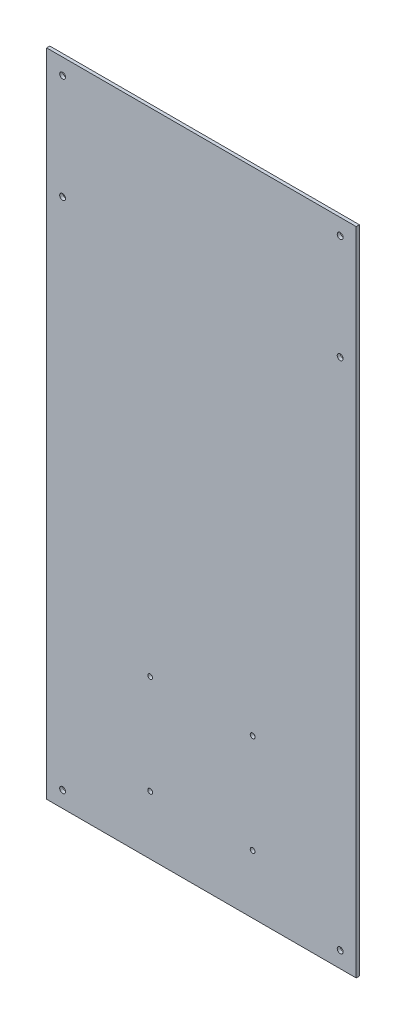
ISO-10303-21;
HEADER;
FILE_DESCRIPTION(('STEP AP214'),'2;1');
FILE_NAME('part.step','',(''),(''),'','','');
FILE_SCHEMA(('AUTOMOTIVE_DESIGN { 1 0 10303 214 1 1 1 1 }'));
ENDSEC;
DATA;
#1=APPLICATION_CONTEXT('core data for automotive mechanical design processes');
#2=APPLICATION_PROTOCOL_DEFINITION('international standard','automotive_design',2000,#1);
#3=PRODUCT_CONTEXT('',#1,'mechanical');
#4=PRODUCT('Part','Part','',(#3));
#5=PRODUCT_RELATED_PRODUCT_CATEGORY('part','',(#4));
#6=PRODUCT_DEFINITION_FORMATION('','',#4);
#7=PRODUCT_DEFINITION_CONTEXT('part definition',#1,'design');
#8=PRODUCT_DEFINITION('design','',#6,#7);
#9=PRODUCT_DEFINITION_SHAPE('','',#8);
#10=(LENGTH_UNIT() NAMED_UNIT(*) SI_UNIT(.MILLI.,.METRE.));
#11=(NAMED_UNIT(*) PLANE_ANGLE_UNIT() SI_UNIT($,.RADIAN.));
#12=(NAMED_UNIT(*) SI_UNIT($,.STERADIAN.) SOLID_ANGLE_UNIT());
#13=UNCERTAINTY_MEASURE_WITH_UNIT(LENGTH_MEASURE(1.E-05),#10,'distance_accuracy_value','');
#14=(GEOMETRIC_REPRESENTATION_CONTEXT(3) GLOBAL_UNCERTAINTY_ASSIGNED_CONTEXT((#13)) GLOBAL_UNIT_ASSIGNED_CONTEXT((#10,
#11,#12)) REPRESENTATION_CONTEXT('',''));
#15=CARTESIAN_POINT('',(0.,0.,0.));
#16=DIRECTION('',(0.,0.,1.));
#17=DIRECTION('',(1.,0.,0.));
#18=AXIS2_PLACEMENT_3D('',#15,#16,#17);
#19=CARTESIAN_POINT('',(145.,304.8,3.));
#20=DIRECTION('',(-1.,0.,0.));
#21=DIRECTION('',(0.,-1.,0.));
#22=AXIS2_PLACEMENT_3D('',#19,#20,#21);
#23=PLANE('',#22);
#24=DIRECTION('',(0.,1.,0.));
#25=VECTOR('',#24,1.);
#26=CARTESIAN_POINT('',(145.,304.8,0.));
#27=LINE('',#26,#25);
#28=CARTESIAN_POINT('',(145.,-304.8,0.));
#29=VERTEX_POINT('',#28);
#30=CARTESIAN_POINT('',(145.,304.8,0.));
#31=VERTEX_POINT('',#30);
#32=EDGE_CURVE('E98',#29,#31,#27,.T.);
#33=ORIENTED_EDGE('',*,*,#32,.T.);
#34=DIRECTION('',(0.,0.,-1.));
#35=VECTOR('',#34,1.);
#36=CARTESIAN_POINT('',(145.,304.8,3.));
#37=LINE('',#36,#35);
#38=CARTESIAN_POINT('',(145.,304.8,3.));
#39=VERTEX_POINT('',#38);
#40=EDGE_CURVE('E11',#39,#31,#37,.T.);
#41=ORIENTED_EDGE('',*,*,#40,.F.);
#42=DIRECTION('',(0.,1.,0.));
#43=VECTOR('',#42,1.);
#44=CARTESIAN_POINT('',(145.,304.8,3.));
#45=LINE('',#44,#43);
#46=CARTESIAN_POINT('',(145.,-304.8,3.));
#47=VERTEX_POINT('',#46);
#48=EDGE_CURVE('E86',#47,#39,#45,.T.);
#49=ORIENTED_EDGE('',*,*,#48,.F.);
#50=DIRECTION('',(0.,0.,-1.));
#51=VECTOR('',#50,1.);
#52=CARTESIAN_POINT('',(145.,-304.8,3.));
#53=LINE('',#52,#51);
#54=EDGE_CURVE('E94',#47,#29,#53,.T.);
#55=ORIENTED_EDGE('',*,*,#54,.T.);
#56=EDGE_LOOP('',(#33,#41,#49,#55));
#57=FACE_BOUND('',#56,.T.);
#58=ADVANCED_FACE('F35',(#57),#23,.F.);
#59=CARTESIAN_POINT('',(-145.,304.8,3.));
#60=DIRECTION('',(0.,-1.,0.));
#61=DIRECTION('',(0.,0.,-1.));
#62=AXIS2_PLACEMENT_3D('',#59,#60,#61);
#63=PLANE('',#62);
#64=DIRECTION('',(-1.,0.,0.));
#65=VECTOR('',#64,1.);
#66=CARTESIAN_POINT('',(-145.,304.8,0.));
#67=LINE('',#66,#65);
#68=CARTESIAN_POINT('',(-145.,304.8,0.));
#69=VERTEX_POINT('',#68);
#70=EDGE_CURVE('E90',#31,#69,#67,.T.);
#71=ORIENTED_EDGE('',*,*,#70,.T.);
#72=DIRECTION('',(0.,0.,-1.));
#73=VECTOR('',#72,1.);
#74=CARTESIAN_POINT('',(-145.,304.8,3.));
#75=LINE('',#74,#73);
#76=CARTESIAN_POINT('',(-145.,304.8,3.));
#77=VERTEX_POINT('',#76);
#78=EDGE_CURVE('E43',#77,#69,#75,.T.);
#79=ORIENTED_EDGE('',*,*,#78,.F.);
#80=DIRECTION('',(-1.,0.,0.));
#81=VECTOR('',#80,1.);
#82=CARTESIAN_POINT('',(-145.,304.8,3.));
#83=LINE('',#82,#81);
#84=EDGE_CURVE('E81',#39,#77,#83,.T.);
#85=ORIENTED_EDGE('',*,*,#84,.F.);
#86=ORIENTED_EDGE('',*,*,#40,.T.);
#87=EDGE_LOOP('',(#71,#79,#85,#86));
#88=FACE_BOUND('',#87,.T.);
#89=ADVANCED_FACE('F89',(#88),#63,.F.);
#90=CARTESIAN_POINT('',(-145.,304.8,3.));
#91=DIRECTION('',(1.,0.,0.));
#92=DIRECTION('',(0.,1.,0.));
#93=AXIS2_PLACEMENT_3D('',#90,#91,#92);
#94=PLANE('',#93);
#95=DIRECTION('',(0.,-1.,0.));
#96=VECTOR('',#95,1.);
#97=CARTESIAN_POINT('',(-145.,304.8,0.));
#98=LINE('',#97,#96);
#99=CARTESIAN_POINT('',(-145.,-304.8,0.));
#100=VERTEX_POINT('',#99);
#101=EDGE_CURVE('E68',#69,#100,#98,.T.);
#102=ORIENTED_EDGE('',*,*,#101,.T.);
#103=DIRECTION('',(0.,0.,-1.));
#104=VECTOR('',#103,1.);
#105=CARTESIAN_POINT('',(-145.,-304.8,3.));
#106=LINE('',#105,#104);
#107=CARTESIAN_POINT('',(-145.,-304.8,3.));
#108=VERTEX_POINT('',#107);
#109=EDGE_CURVE('E91',#108,#100,#106,.T.);
#110=ORIENTED_EDGE('',*,*,#109,.F.);
#111=DIRECTION('',(0.,-1.,0.));
#112=VECTOR('',#111,1.);
#113=CARTESIAN_POINT('',(-145.,304.8,3.));
#114=LINE('',#113,#112);
#115=EDGE_CURVE('E84',#77,#108,#114,.T.);
#116=ORIENTED_EDGE('',*,*,#115,.F.);
#117=ORIENTED_EDGE('',*,*,#78,.T.);
#118=EDGE_LOOP('',(#102,#110,#116,#117));
#119=FACE_BOUND('',#118,.T.);
#120=ADVANCED_FACE('F92',(#119),#94,.F.);
#121=CARTESIAN_POINT('',(-145.,-304.8,3.));
#122=DIRECTION('',(0.,1.,0.));
#123=DIRECTION('',(0.,0.,1.));
#124=AXIS2_PLACEMENT_3D('',#121,#122,#123);
#125=PLANE('',#124);
#126=DIRECTION('',(1.,0.,0.));
#127=VECTOR('',#126,1.);
#128=CARTESIAN_POINT('',(-145.,-304.8,0.));
#129=LINE('',#128,#127);
#130=EDGE_CURVE('E74',#100,#29,#129,.T.);
#131=ORIENTED_EDGE('',*,*,#130,.T.);
#132=ORIENTED_EDGE('',*,*,#54,.F.);
#133=DIRECTION('',(1.,0.,0.));
#134=VECTOR('',#133,1.);
#135=CARTESIAN_POINT('',(-145.,-304.8,3.));
#136=LINE('',#135,#134);
#137=EDGE_CURVE('E51',#108,#47,#136,.T.);
#138=ORIENTED_EDGE('',*,*,#137,.F.);
#139=ORIENTED_EDGE('',*,*,#109,.T.);
#140=EDGE_LOOP('',(#131,#132,#138,#139));
#141=FACE_BOUND('',#140,.T.);
#142=ADVANCED_FACE('F106',(#141),#125,.F.);
#143=CARTESIAN_POINT('',(0.,0.,3.));
#144=DIRECTION('',(0.,0.,1.));
#145=DIRECTION('',(1.,0.,0.));
#146=AXIS2_PLACEMENT_3D('',#143,#144,#145);
#147=PLANE('',#146);
#148=CARTESIAN_POINT('',(-48.,-156.8,3.));
#149=DIRECTION('',(0.,0.,1.));
#150=DIRECTION('',(1.,0.,0.));
#151=AXIS2_PLACEMENT_3D('',#148,#149,#150);
#152=CIRCLE('',#151,2.25);
#153=CARTESIAN_POINT('',(-45.75,-156.8,3.));
#154=VERTEX_POINT('',#153);
#155=EDGE_CURVE('E168',#154,#154,#152,.T.);
#156=ORIENTED_EDGE('',*,*,#155,.F.);
#157=EDGE_LOOP('',(#156));
#158=FACE_BOUND('',#157,.T.);
#159=CARTESIAN_POINT('',(-48.,-249.8,3.));
#160=DIRECTION('',(0.,0.,1.));
#161=DIRECTION('',(1.,0.,0.));
#162=AXIS2_PLACEMENT_3D('',#159,#160,#161);
#163=CIRCLE('',#162,2.25);
#164=CARTESIAN_POINT('',(-45.75,-249.8,3.));
#165=VERTEX_POINT('',#164);
#166=EDGE_CURVE('E162',#165,#165,#163,.T.);
#167=ORIENTED_EDGE('',*,*,#166,.F.);
#168=EDGE_LOOP('',(#167));
#169=FACE_BOUND('',#168,.T.);
#170=CARTESIAN_POINT('',(48.,-249.8,3.));
#171=DIRECTION('',(0.,0.,1.));
#172=DIRECTION('',(1.,0.,0.));
#173=AXIS2_PLACEMENT_3D('',#170,#171,#172);
#174=CIRCLE('',#173,2.25);
#175=CARTESIAN_POINT('',(50.25,-249.8,3.));
#176=VERTEX_POINT('',#175);
#177=EDGE_CURVE('E156',#176,#176,#174,.T.);
#178=ORIENTED_EDGE('',*,*,#177,.F.);
#179=EDGE_LOOP('',(#178));
#180=FACE_BOUND('',#179,.T.);
#181=CARTESIAN_POINT('',(48.,-156.8,3.));
#182=DIRECTION('',(0.,0.,1.));
#183=DIRECTION('',(1.,0.,0.));
#184=AXIS2_PLACEMENT_3D('',#181,#182,#183);
#185=CIRCLE('',#184,2.25);
#186=CARTESIAN_POINT('',(50.25,-156.8,3.));
#187=VERTEX_POINT('',#186);
#188=EDGE_CURVE('E150',#187,#187,#185,.T.);
#189=ORIENTED_EDGE('',*,*,#188,.F.);
#190=EDGE_LOOP('',(#189));
#191=FACE_BOUND('',#190,.T.);
#192=CARTESIAN_POINT('',(129.995,289.795,3.));
#193=DIRECTION('',(0.,0.,1.));
#194=DIRECTION('',(1.,0.,0.));
#195=AXIS2_PLACEMENT_3D('',#192,#193,#194);
#196=CIRCLE('',#195,2.75);
#197=CARTESIAN_POINT('',(132.745,289.795,3.));
#198=VERTEX_POINT('',#197);
#199=EDGE_CURVE('E144',#198,#198,#196,.T.);
#200=ORIENTED_EDGE('',*,*,#199,.F.);
#201=EDGE_LOOP('',(#200));
#202=FACE_BOUND('',#201,.T.);
#203=CARTESIAN_POINT('',(-129.995,289.795,3.));
#204=DIRECTION('',(0.,0.,1.));
#205=DIRECTION('',(1.,0.,0.));
#206=AXIS2_PLACEMENT_3D('',#203,#204,#205);
#207=CIRCLE('',#206,2.75);
#208=CARTESIAN_POINT('',(-127.245,289.795,3.));
#209=VERTEX_POINT('',#208);
#210=EDGE_CURVE('E138',#209,#209,#207,.T.);
#211=ORIENTED_EDGE('',*,*,#210,.F.);
#212=EDGE_LOOP('',(#211));
#213=FACE_BOUND('',#212,.T.);
#214=CARTESIAN_POINT('',(-129.995,-289.795,3.));
#215=DIRECTION('',(0.,0.,1.));
#216=DIRECTION('',(1.,0.,0.));
#217=AXIS2_PLACEMENT_3D('',#214,#215,#216);
#218=CIRCLE('',#217,2.75);
#219=CARTESIAN_POINT('',(-127.245,-289.795,3.));
#220=VERTEX_POINT('',#219);
#221=EDGE_CURVE('E132',#220,#220,#218,.T.);
#222=ORIENTED_EDGE('',*,*,#221,.F.);
#223=EDGE_LOOP('',(#222));
#224=FACE_BOUND('',#223,.T.);
#225=CARTESIAN_POINT('',(129.995,-289.795,3.));
#226=DIRECTION('',(0.,0.,1.));
#227=DIRECTION('',(1.,0.,0.));
#228=AXIS2_PLACEMENT_3D('',#225,#226,#227);
#229=CIRCLE('',#228,2.75);
#230=CARTESIAN_POINT('',(132.745,-289.795,3.));
#231=VERTEX_POINT('',#230);
#232=EDGE_CURVE('E126',#231,#231,#229,.T.);
#233=ORIENTED_EDGE('',*,*,#232,.F.);
#234=EDGE_LOOP('',(#233));
#235=FACE_BOUND('',#234,.T.);
#236=CARTESIAN_POINT('',(129.995,191.395,3.));
#237=DIRECTION('',(0.,0.,1.));
#238=DIRECTION('',(1.,0.,0.));
#239=AXIS2_PLACEMENT_3D('',#236,#237,#238);
#240=CIRCLE('',#239,2.75);
#241=CARTESIAN_POINT('',(132.745,191.395,3.));
#242=VERTEX_POINT('',#241);
#243=EDGE_CURVE('E120',#242,#242,#240,.T.);
#244=ORIENTED_EDGE('',*,*,#243,.F.);
#245=EDGE_LOOP('',(#244));
#246=FACE_BOUND('',#245,.T.);
#247=CARTESIAN_POINT('',(-129.995,191.395,3.));
#248=DIRECTION('',(0.,0.,1.));
#249=DIRECTION('',(1.,0.,0.));
#250=AXIS2_PLACEMENT_3D('',#247,#248,#249);
#251=CIRCLE('',#250,2.75);
#252=CARTESIAN_POINT('',(-127.245,191.395,3.));
#253=VERTEX_POINT('',#252);
#254=EDGE_CURVE('E114',#253,#253,#251,.T.);
#255=ORIENTED_EDGE('',*,*,#254,.F.);
#256=EDGE_LOOP('',(#255));
#257=FACE_BOUND('',#256,.T.);
#258=ORIENTED_EDGE('',*,*,#48,.T.);
#259=ORIENTED_EDGE('',*,*,#84,.T.);
#260=ORIENTED_EDGE('',*,*,#115,.T.);
#261=ORIENTED_EDGE('',*,*,#137,.T.);
#262=EDGE_LOOP('',(#258,#259,#260,#261));
#263=FACE_BOUND('',#262,.T.);
#264=ADVANCED_FACE('F82',(#158,#169,#180,#191,#202,#213,#224,#235,#246,#257,#263),#147,.T.);
#265=CARTESIAN_POINT('',(0.,0.,0.));
#266=DIRECTION('',(0.,0.,1.));
#267=DIRECTION('',(1.,0.,0.));
#268=AXIS2_PLACEMENT_3D('',#265,#266,#267);
#269=PLANE('',#268);
#270=CARTESIAN_POINT('',(-48.,-156.8,0.));
#271=DIRECTION('',(0.,0.,1.));
#272=DIRECTION('',(1.,0.,0.));
#273=AXIS2_PLACEMENT_3D('',#270,#271,#272);
#274=CIRCLE('',#273,2.25);
#275=CARTESIAN_POINT('',(-45.75,-156.8,0.));
#276=VERTEX_POINT('',#275);
#277=EDGE_CURVE('E165',#276,#276,#274,.T.);
#278=ORIENTED_EDGE('',*,*,#277,.T.);
#279=EDGE_LOOP('',(#278));
#280=FACE_BOUND('',#279,.T.);
#281=CARTESIAN_POINT('',(-48.,-249.8,0.));
#282=DIRECTION('',(0.,0.,1.));
#283=DIRECTION('',(1.,0.,0.));
#284=AXIS2_PLACEMENT_3D('',#281,#282,#283);
#285=CIRCLE('',#284,2.25);
#286=CARTESIAN_POINT('',(-45.75,-249.8,0.));
#287=VERTEX_POINT('',#286);
#288=EDGE_CURVE('E159',#287,#287,#285,.T.);
#289=ORIENTED_EDGE('',*,*,#288,.T.);
#290=EDGE_LOOP('',(#289));
#291=FACE_BOUND('',#290,.T.);
#292=CARTESIAN_POINT('',(48.,-249.8,0.));
#293=DIRECTION('',(0.,0.,1.));
#294=DIRECTION('',(1.,0.,0.));
#295=AXIS2_PLACEMENT_3D('',#292,#293,#294);
#296=CIRCLE('',#295,2.25);
#297=CARTESIAN_POINT('',(50.25,-249.8,0.));
#298=VERTEX_POINT('',#297);
#299=EDGE_CURVE('E153',#298,#298,#296,.T.);
#300=ORIENTED_EDGE('',*,*,#299,.T.);
#301=EDGE_LOOP('',(#300));
#302=FACE_BOUND('',#301,.T.);
#303=CARTESIAN_POINT('',(48.,-156.8,0.));
#304=DIRECTION('',(0.,0.,1.));
#305=DIRECTION('',(1.,0.,0.));
#306=AXIS2_PLACEMENT_3D('',#303,#304,#305);
#307=CIRCLE('',#306,2.25);
#308=CARTESIAN_POINT('',(50.25,-156.8,0.));
#309=VERTEX_POINT('',#308);
#310=EDGE_CURVE('E147',#309,#309,#307,.T.);
#311=ORIENTED_EDGE('',*,*,#310,.T.);
#312=EDGE_LOOP('',(#311));
#313=FACE_BOUND('',#312,.T.);
#314=CARTESIAN_POINT('',(129.995,289.795,0.));
#315=DIRECTION('',(0.,0.,1.));
#316=DIRECTION('',(1.,0.,0.));
#317=AXIS2_PLACEMENT_3D('',#314,#315,#316);
#318=CIRCLE('',#317,2.75);
#319=CARTESIAN_POINT('',(132.745,289.795,0.));
#320=VERTEX_POINT('',#319);
#321=EDGE_CURVE('E141',#320,#320,#318,.T.);
#322=ORIENTED_EDGE('',*,*,#321,.T.);
#323=EDGE_LOOP('',(#322));
#324=FACE_BOUND('',#323,.T.);
#325=CARTESIAN_POINT('',(-129.995,289.795,0.));
#326=DIRECTION('',(0.,0.,1.));
#327=DIRECTION('',(1.,0.,0.));
#328=AXIS2_PLACEMENT_3D('',#325,#326,#327);
#329=CIRCLE('',#328,2.75);
#330=CARTESIAN_POINT('',(-127.245,289.795,0.));
#331=VERTEX_POINT('',#330);
#332=EDGE_CURVE('E135',#331,#331,#329,.T.);
#333=ORIENTED_EDGE('',*,*,#332,.T.);
#334=EDGE_LOOP('',(#333));
#335=FACE_BOUND('',#334,.T.);
#336=CARTESIAN_POINT('',(-129.995,-289.795,0.));
#337=DIRECTION('',(0.,0.,1.));
#338=DIRECTION('',(1.,0.,0.));
#339=AXIS2_PLACEMENT_3D('',#336,#337,#338);
#340=CIRCLE('',#339,2.75);
#341=CARTESIAN_POINT('',(-127.245,-289.795,0.));
#342=VERTEX_POINT('',#341);
#343=EDGE_CURVE('E129',#342,#342,#340,.T.);
#344=ORIENTED_EDGE('',*,*,#343,.T.);
#345=EDGE_LOOP('',(#344));
#346=FACE_BOUND('',#345,.T.);
#347=CARTESIAN_POINT('',(129.995,-289.795,0.));
#348=DIRECTION('',(0.,0.,1.));
#349=DIRECTION('',(1.,0.,0.));
#350=AXIS2_PLACEMENT_3D('',#347,#348,#349);
#351=CIRCLE('',#350,2.75);
#352=CARTESIAN_POINT('',(132.745,-289.795,0.));
#353=VERTEX_POINT('',#352);
#354=EDGE_CURVE('E123',#353,#353,#351,.T.);
#355=ORIENTED_EDGE('',*,*,#354,.T.);
#356=EDGE_LOOP('',(#355));
#357=FACE_BOUND('',#356,.T.);
#358=CARTESIAN_POINT('',(129.995,191.395,0.));
#359=DIRECTION('',(0.,0.,1.));
#360=DIRECTION('',(1.,0.,0.));
#361=AXIS2_PLACEMENT_3D('',#358,#359,#360);
#362=CIRCLE('',#361,2.75);
#363=CARTESIAN_POINT('',(132.745,191.395,0.));
#364=VERTEX_POINT('',#363);
#365=EDGE_CURVE('E117',#364,#364,#362,.T.);
#366=ORIENTED_EDGE('',*,*,#365,.T.);
#367=EDGE_LOOP('',(#366));
#368=FACE_BOUND('',#367,.T.);
#369=CARTESIAN_POINT('',(-129.995,191.395,0.));
#370=DIRECTION('',(0.,0.,1.));
#371=DIRECTION('',(1.,0.,0.));
#372=AXIS2_PLACEMENT_3D('',#369,#370,#371);
#373=CIRCLE('',#372,2.75);
#374=CARTESIAN_POINT('',(-127.245,191.395,0.));
#375=VERTEX_POINT('',#374);
#376=EDGE_CURVE('E101',#375,#375,#373,.T.);
#377=ORIENTED_EDGE('',*,*,#376,.T.);
#378=EDGE_LOOP('',(#377));
#379=FACE_BOUND('',#378,.T.);
#380=ORIENTED_EDGE('',*,*,#32,.F.);
#381=ORIENTED_EDGE('',*,*,#130,.F.);
#382=ORIENTED_EDGE('',*,*,#101,.F.);
#383=ORIENTED_EDGE('',*,*,#70,.F.);
#384=EDGE_LOOP('',(#380,#381,#382,#383));
#385=FACE_BOUND('',#384,.T.);
#386=ADVANCED_FACE('F109',(#280,#291,#302,#313,#324,#335,#346,#357,#368,#379,#385),#269,.F.);
#387=CARTESIAN_POINT('',(-129.995,191.395,3.));
#388=DIRECTION('',(0.,0.,1.));
#389=DIRECTION('',(1.,0.,0.));
#390=AXIS2_PLACEMENT_3D('',#387,#388,#389);
#391=CYLINDRICAL_SURFACE('',#390,2.75);
#392=ORIENTED_EDGE('',*,*,#376,.F.);
#393=EDGE_LOOP('',(#392));
#394=FACE_BOUND('',#393,.T.);
#395=ORIENTED_EDGE('',*,*,#254,.T.);
#396=EDGE_LOOP('',(#395));
#397=FACE_BOUND('',#396,.T.);
#398=ADVANCED_FACE('F195',(#394,#397),#391,.F.);
#399=CARTESIAN_POINT('',(129.995,191.395,3.));
#400=DIRECTION('',(0.,0.,1.));
#401=DIRECTION('',(1.,0.,0.));
#402=AXIS2_PLACEMENT_3D('',#399,#400,#401);
#403=CYLINDRICAL_SURFACE('',#402,2.75);
#404=ORIENTED_EDGE('',*,*,#365,.F.);
#405=EDGE_LOOP('',(#404));
#406=FACE_BOUND('',#405,.T.);
#407=ORIENTED_EDGE('',*,*,#243,.T.);
#408=EDGE_LOOP('',(#407));
#409=FACE_BOUND('',#408,.T.);
#410=ADVANCED_FACE('F197',(#406,#409),#403,.F.);
#411=CARTESIAN_POINT('',(129.995,-289.795,3.));
#412=DIRECTION('',(0.,0.,1.));
#413=DIRECTION('',(1.,0.,0.));
#414=AXIS2_PLACEMENT_3D('',#411,#412,#413);
#415=CYLINDRICAL_SURFACE('',#414,2.75);
#416=ORIENTED_EDGE('',*,*,#354,.F.);
#417=EDGE_LOOP('',(#416));
#418=FACE_BOUND('',#417,.T.);
#419=ORIENTED_EDGE('',*,*,#232,.T.);
#420=EDGE_LOOP('',(#419));
#421=FACE_BOUND('',#420,.T.);
#422=ADVANCED_FACE('F204',(#418,#421),#415,.F.);
#423=CARTESIAN_POINT('',(-129.995,-289.795,3.));
#424=DIRECTION('',(0.,0.,1.));
#425=DIRECTION('',(1.,0.,0.));
#426=AXIS2_PLACEMENT_3D('',#423,#424,#425);
#427=CYLINDRICAL_SURFACE('',#426,2.75);
#428=ORIENTED_EDGE('',*,*,#343,.F.);
#429=EDGE_LOOP('',(#428));
#430=FACE_BOUND('',#429,.T.);
#431=ORIENTED_EDGE('',*,*,#221,.T.);
#432=EDGE_LOOP('',(#431));
#433=FACE_BOUND('',#432,.T.);
#434=ADVANCED_FACE('F287',(#430,#433),#427,.F.);
#435=CARTESIAN_POINT('',(-129.995,289.795,3.));
#436=DIRECTION('',(0.,0.,1.));
#437=DIRECTION('',(1.,0.,0.));
#438=AXIS2_PLACEMENT_3D('',#435,#436,#437);
#439=CYLINDRICAL_SURFACE('',#438,2.75);
#440=ORIENTED_EDGE('',*,*,#332,.F.);
#441=EDGE_LOOP('',(#440));
#442=FACE_BOUND('',#441,.T.);
#443=ORIENTED_EDGE('',*,*,#210,.T.);
#444=EDGE_LOOP('',(#443));
#445=FACE_BOUND('',#444,.T.);
#446=ADVANCED_FACE('F283',(#442,#445),#439,.F.);
#447=CARTESIAN_POINT('',(129.995,289.795,3.));
#448=DIRECTION('',(0.,0.,1.));
#449=DIRECTION('',(1.,0.,0.));
#450=AXIS2_PLACEMENT_3D('',#447,#448,#449);
#451=CYLINDRICAL_SURFACE('',#450,2.75);
#452=ORIENTED_EDGE('',*,*,#321,.F.);
#453=EDGE_LOOP('',(#452));
#454=FACE_BOUND('',#453,.T.);
#455=ORIENTED_EDGE('',*,*,#199,.T.);
#456=EDGE_LOOP('',(#455));
#457=FACE_BOUND('',#456,.T.);
#458=ADVANCED_FACE('F245',(#454,#457),#451,.F.);
#459=CARTESIAN_POINT('',(48.,-156.8,3.));
#460=DIRECTION('',(0.,0.,1.));
#461=DIRECTION('',(1.,0.,0.));
#462=AXIS2_PLACEMENT_3D('',#459,#460,#461);
#463=CYLINDRICAL_SURFACE('',#462,2.25);
#464=ORIENTED_EDGE('',*,*,#310,.F.);
#465=EDGE_LOOP('',(#464));
#466=FACE_BOUND('',#465,.T.);
#467=ORIENTED_EDGE('',*,*,#188,.T.);
#468=EDGE_LOOP('',(#467));
#469=FACE_BOUND('',#468,.T.);
#470=ADVANCED_FACE('F239',(#466,#469),#463,.F.);
#471=CARTESIAN_POINT('',(48.,-249.8,3.));
#472=DIRECTION('',(0.,0.,1.));
#473=DIRECTION('',(1.,0.,0.));
#474=AXIS2_PLACEMENT_3D('',#471,#472,#473);
#475=CYLINDRICAL_SURFACE('',#474,2.25);
#476=ORIENTED_EDGE('',*,*,#299,.F.);
#477=EDGE_LOOP('',(#476));
#478=FACE_BOUND('',#477,.T.);
#479=ORIENTED_EDGE('',*,*,#177,.T.);
#480=EDGE_LOOP('',(#479));
#481=FACE_BOUND('',#480,.T.);
#482=ADVANCED_FACE('F244',(#478,#481),#475,.F.);
#483=CARTESIAN_POINT('',(-48.,-249.8,3.));
#484=DIRECTION('',(0.,0.,1.));
#485=DIRECTION('',(1.,0.,0.));
#486=AXIS2_PLACEMENT_3D('',#483,#484,#485);
#487=CYLINDRICAL_SURFACE('',#486,2.25);
#488=ORIENTED_EDGE('',*,*,#288,.F.);
#489=EDGE_LOOP('',(#488));
#490=FACE_BOUND('',#489,.T.);
#491=ORIENTED_EDGE('',*,*,#166,.T.);
#492=EDGE_LOOP('',(#491));
#493=FACE_BOUND('',#492,.T.);
#494=ADVANCED_FACE('F257',(#490,#493),#487,.F.);
#495=CARTESIAN_POINT('',(-48.,-156.8,3.));
#496=DIRECTION('',(0.,0.,1.));
#497=DIRECTION('',(1.,0.,0.));
#498=AXIS2_PLACEMENT_3D('',#495,#496,#497);
#499=CYLINDRICAL_SURFACE('',#498,2.25);
#500=ORIENTED_EDGE('',*,*,#277,.F.);
#501=EDGE_LOOP('',(#500));
#502=FACE_BOUND('',#501,.T.);
#503=ORIENTED_EDGE('',*,*,#155,.T.);
#504=EDGE_LOOP('',(#503));
#505=FACE_BOUND('',#504,.T.);
#506=ADVANCED_FACE('F172',(#502,#505),#499,.F.);
#507=CLOSED_SHELL('',(#58,#89,#120,#142,#264,#386,#398,#410,#422,#434,#446,#458,#470,#482,#494,#506));
#508=MANIFOLD_SOLID_BREP('B2',#507);
#509=ADVANCED_BREP_SHAPE_REPRESENTATION('',(#18,#508),#14);
#510=SHAPE_DEFINITION_REPRESENTATION(#9,#509);
ENDSEC;
END-ISO-10303-21;
